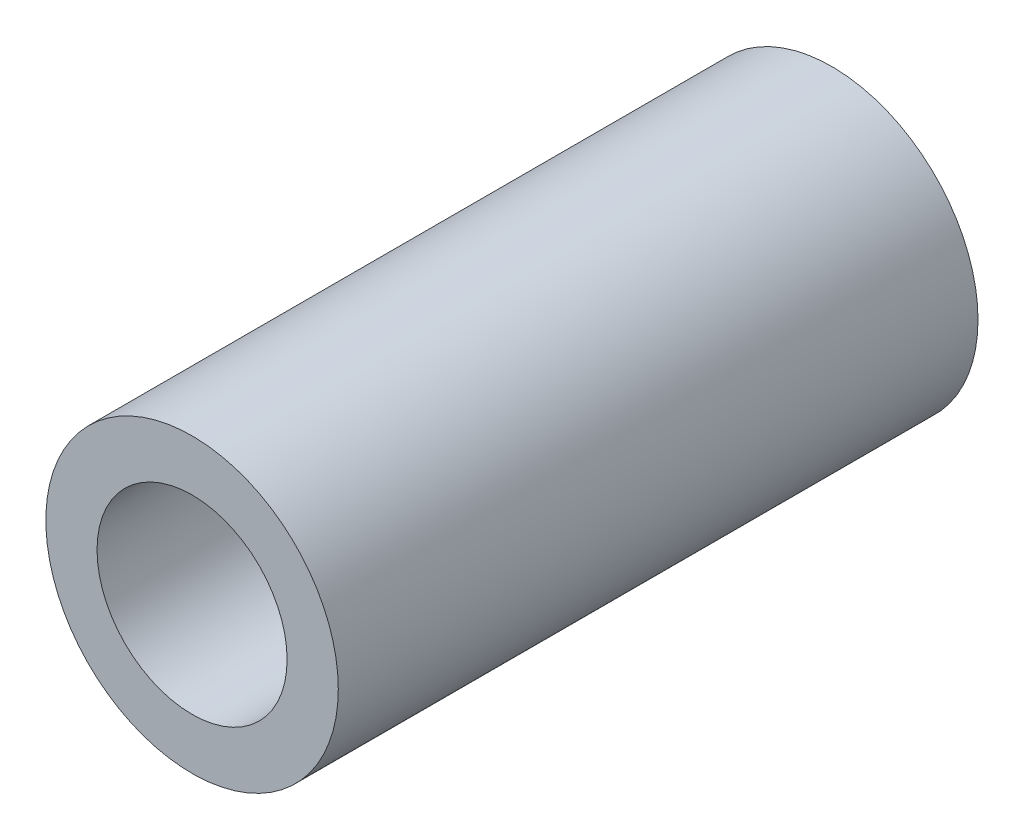
ISO-10303-21;
HEADER;
FILE_DESCRIPTION(('STEP AP214'),'2;1');
FILE_NAME('part.step','',(''),(''),'','','');
FILE_SCHEMA(('AUTOMOTIVE_DESIGN { 1 0 10303 214 1 1 1 1 }'));
ENDSEC;
DATA;
#1=APPLICATION_CONTEXT('core data for automotive mechanical design processes');
#2=APPLICATION_PROTOCOL_DEFINITION('international standard','automotive_design',2000,#1);
#3=PRODUCT_CONTEXT('',#1,'mechanical');
#4=PRODUCT('Part','Part','',(#3));
#5=PRODUCT_RELATED_PRODUCT_CATEGORY('part','',(#4));
#6=PRODUCT_DEFINITION_FORMATION('','',#4);
#7=PRODUCT_DEFINITION_CONTEXT('part definition',#1,'design');
#8=PRODUCT_DEFINITION('design','',#6,#7);
#9=PRODUCT_DEFINITION_SHAPE('','',#8);
#10=(LENGTH_UNIT() NAMED_UNIT(*) SI_UNIT(.MILLI.,.METRE.));
#11=(NAMED_UNIT(*) PLANE_ANGLE_UNIT() SI_UNIT($,.RADIAN.));
#12=(NAMED_UNIT(*) SI_UNIT($,.STERADIAN.) SOLID_ANGLE_UNIT());
#13=UNCERTAINTY_MEASURE_WITH_UNIT(LENGTH_MEASURE(1.E-05),#10,'distance_accuracy_value','');
#14=(GEOMETRIC_REPRESENTATION_CONTEXT(3) GLOBAL_UNCERTAINTY_ASSIGNED_CONTEXT((#13)) GLOBAL_UNIT_ASSIGNED_CONTEXT((#10,
#11,#12)) REPRESENTATION_CONTEXT('',''));
#15=CARTESIAN_POINT('',(0.,0.,0.));
#16=DIRECTION('',(0.,0.,1.));
#17=DIRECTION('',(1.,0.,0.));
#18=AXIS2_PLACEMENT_3D('',#15,#16,#17);
#19=CARTESIAN_POINT('',(0.,0.,35.));
#20=DIRECTION('',(0.,0.,1.));
#21=DIRECTION('',(1.,0.,0.));
#22=AXIS2_PLACEMENT_3D('',#19,#20,#21);
#23=PLANE('',#22);
#24=CARTESIAN_POINT('',(0.,0.,35.));
#25=DIRECTION('',(0.,0.,1.));
#26=DIRECTION('',(1.,0.,0.));
#27=AXIS2_PLACEMENT_3D('',#24,#25,#26);
#28=CIRCLE('',#27,8.);
#29=CARTESIAN_POINT('',(8.,0.,35.));
#30=VERTEX_POINT('',#29);
#31=EDGE_CURVE('E12',#30,#30,#28,.T.);
#32=ORIENTED_EDGE('',*,*,#31,.T.);
#33=EDGE_LOOP('',(#32));
#34=FACE_BOUND('',#33,.T.);
#35=CARTESIAN_POINT('',(0.,0.,35.));
#36=DIRECTION('',(0.,0.,1.));
#37=DIRECTION('',(1.,0.,0.));
#38=AXIS2_PLACEMENT_3D('',#35,#36,#37);
#39=CIRCLE('',#38,5.2);
#40=CARTESIAN_POINT('',(5.2,0.,35.));
#41=VERTEX_POINT('',#40);
#42=EDGE_CURVE('E60',#41,#41,#39,.T.);
#43=ORIENTED_EDGE('',*,*,#42,.F.);
#44=EDGE_LOOP('',(#43));
#45=FACE_BOUND('',#44,.T.);
#46=ADVANCED_FACE('F47',(#34,#45),#23,.T.);
#47=CARTESIAN_POINT('',(0.,0.,0.));
#48=DIRECTION('',(0.,0.,1.));
#49=DIRECTION('',(1.,0.,0.));
#50=AXIS2_PLACEMENT_3D('',#47,#48,#49);
#51=PLANE('',#50);
#52=CARTESIAN_POINT('',(0.,0.,0.));
#53=DIRECTION('',(0.,0.,1.));
#54=DIRECTION('',(1.,0.,0.));
#55=AXIS2_PLACEMENT_3D('',#52,#53,#54);
#56=CIRCLE('',#55,8.);
#57=CARTESIAN_POINT('',(8.,0.,0.));
#58=VERTEX_POINT('',#57);
#59=EDGE_CURVE('E51',#58,#58,#56,.T.);
#60=ORIENTED_EDGE('',*,*,#59,.F.);
#61=EDGE_LOOP('',(#60));
#62=FACE_BOUND('',#61,.T.);
#63=CARTESIAN_POINT('',(0.,0.,0.));
#64=DIRECTION('',(0.,0.,1.));
#65=DIRECTION('',(1.,0.,0.));
#66=AXIS2_PLACEMENT_3D('',#63,#64,#65);
#67=CIRCLE('',#66,5.2);
#68=CARTESIAN_POINT('',(5.2,0.,0.));
#69=VERTEX_POINT('',#68);
#70=EDGE_CURVE('E62',#69,#69,#67,.T.);
#71=ORIENTED_EDGE('',*,*,#70,.T.);
#72=EDGE_LOOP('',(#71));
#73=FACE_BOUND('',#72,.T.);
#74=ADVANCED_FACE('F74',(#62,#73),#51,.F.);
#75=CARTESIAN_POINT('',(0.,0.,35.));
#76=DIRECTION('',(0.,0.,-1.));
#77=DIRECTION('',(-1.,0.,0.));
#78=AXIS2_PLACEMENT_3D('',#75,#76,#77);
#79=CYLINDRICAL_SURFACE('',#78,8.);
#80=ORIENTED_EDGE('',*,*,#31,.F.);
#81=EDGE_LOOP('',(#80));
#82=FACE_BOUND('',#81,.T.);
#83=ORIENTED_EDGE('',*,*,#59,.T.);
#84=EDGE_LOOP('',(#83));
#85=FACE_BOUND('',#84,.T.);
#86=ADVANCED_FACE('F49',(#82,#85),#79,.T.);
#87=CARTESIAN_POINT('',(0.,0.,35.));
#88=DIRECTION('',(0.,0.,-1.));
#89=DIRECTION('',(-1.,0.,0.));
#90=AXIS2_PLACEMENT_3D('',#87,#88,#89);
#91=CYLINDRICAL_SURFACE('',#90,5.2);
#92=ORIENTED_EDGE('',*,*,#42,.T.);
#93=EDGE_LOOP('',(#92));
#94=FACE_BOUND('',#93,.T.);
#95=ORIENTED_EDGE('',*,*,#70,.F.);
#96=EDGE_LOOP('',(#95));
#97=FACE_BOUND('',#96,.T.);
#98=ADVANCED_FACE('F70',(#94,#97),#91,.F.);
#99=CLOSED_SHELL('',(#46,#74,#86,#98));
#100=MANIFOLD_SOLID_BREP('B2',#99);
#101=ADVANCED_BREP_SHAPE_REPRESENTATION('',(#18,#100),#14);
#102=SHAPE_DEFINITION_REPRESENTATION(#9,#101);
ENDSEC;
END-ISO-10303-21;
